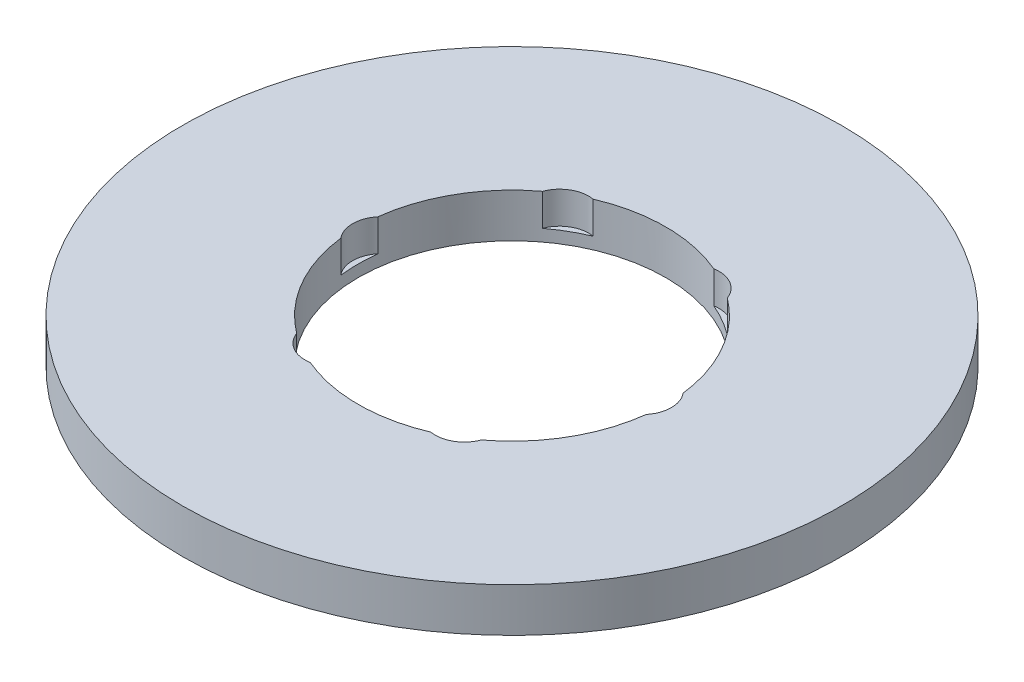
ISO-10303-21;
HEADER;
FILE_DESCRIPTION(('STEP AP214'),'2;1');
FILE_NAME('part.step','',(''),(''),'','','');
FILE_SCHEMA(('AUTOMOTIVE_DESIGN { 1 0 10303 214 1 1 1 1 }'));
ENDSEC;
DATA;
#1=APPLICATION_CONTEXT('core data for automotive mechanical design processes');
#2=APPLICATION_PROTOCOL_DEFINITION('international standard','automotive_design',2000,#1);
#3=PRODUCT_CONTEXT('',#1,'mechanical');
#4=PRODUCT('Part','Part','',(#3));
#5=PRODUCT_RELATED_PRODUCT_CATEGORY('part','',(#4));
#6=PRODUCT_DEFINITION_FORMATION('','',#4);
#7=PRODUCT_DEFINITION_CONTEXT('part definition',#1,'design');
#8=PRODUCT_DEFINITION('design','',#6,#7);
#9=PRODUCT_DEFINITION_SHAPE('','',#8);
#10=(LENGTH_UNIT() NAMED_UNIT(*) SI_UNIT(.MILLI.,.METRE.));
#11=(NAMED_UNIT(*) PLANE_ANGLE_UNIT() SI_UNIT($,.RADIAN.));
#12=(NAMED_UNIT(*) SI_UNIT($,.STERADIAN.) SOLID_ANGLE_UNIT());
#13=UNCERTAINTY_MEASURE_WITH_UNIT(LENGTH_MEASURE(1.E-05),#10,'distance_accuracy_value','');
#14=(GEOMETRIC_REPRESENTATION_CONTEXT(3) GLOBAL_UNCERTAINTY_ASSIGNED_CONTEXT((#13)) GLOBAL_UNIT_ASSIGNED_CONTEXT((#10,
#11,#12)) REPRESENTATION_CONTEXT('',''));
#15=CARTESIAN_POINT('',(0.,0.,0.));
#16=DIRECTION('',(0.,0.,1.));
#17=DIRECTION('',(1.,0.,0.));
#18=AXIS2_PLACEMENT_3D('',#15,#16,#17);
#19=CARTESIAN_POINT('',(0.,5.,0.));
#20=DIRECTION('',(0.,-1.,0.));
#21=DIRECTION('',(0.,0.,-1.));
#22=AXIS2_PLACEMENT_3D('',#19,#20,#21);
#23=CYLINDRICAL_SURFACE('',#22,37.5);
#24=CARTESIAN_POINT('',(0.,5.,0.));
#25=DIRECTION('',(0.,1.,0.));
#26=DIRECTION('',(0.,0.,1.));
#27=AXIS2_PLACEMENT_3D('',#24,#25,#26);
#28=CIRCLE('',#27,37.5);
#29=CARTESIAN_POINT('',(0.,5.,37.5));
#30=VERTEX_POINT('',#29);
#31=EDGE_CURVE('E162',#30,#30,#28,.T.);
#32=ORIENTED_EDGE('',*,*,#31,.F.);
#33=EDGE_LOOP('',(#32));
#34=FACE_BOUND('',#33,.T.);
#35=CARTESIAN_POINT('',(0.,0.,0.));
#36=DIRECTION('',(0.,1.,0.));
#37=DIRECTION('',(0.,0.,1.));
#38=AXIS2_PLACEMENT_3D('',#35,#36,#37);
#39=CIRCLE('',#38,37.5);
#40=CARTESIAN_POINT('',(0.,0.,37.5));
#41=VERTEX_POINT('',#40);
#42=EDGE_CURVE('E157',#41,#41,#39,.T.);
#43=ORIENTED_EDGE('',*,*,#42,.T.);
#44=EDGE_LOOP('',(#43));
#45=FACE_BOUND('',#44,.T.);
#46=ADVANCED_FACE('F39',(#34,#45),#23,.T.);
#47=CARTESIAN_POINT('',(0.,5.,0.));
#48=DIRECTION('',(0.,1.,0.));
#49=DIRECTION('',(0.,0.,1.));
#50=AXIS2_PLACEMENT_3D('',#47,#48,#49);
#51=PLANE('',#50);
#52=CARTESIAN_POINT('',(-7.41666009187124,5.,-12.8460321015891));
#53=DIRECTION('',(0.,1.,0.));
#54=DIRECTION('',(-0.866025403784433,0.,0.50000000000001));
#55=AXIS2_PLACEMENT_3D('',#52,#53,#54);
#56=CIRCLE('',#55,3.29838734099443);
#57=CARTESIAN_POINT('',(-6.86382702181804,5.,-16.097760049602));
#58=VERTEX_POINT('',#57);
#59=CARTESIAN_POINT('',(-10.5091556360728,5.,-13.9931285928772));
#60=VERTEX_POINT('',#59);
#61=EDGE_CURVE('E218',#58,#60,#56,.T.);
#62=ORIENTED_EDGE('',*,*,#61,.F.);
#63=CARTESIAN_POINT('',(0.,5.,0.));
#64=DIRECTION('',(0.,1.,0.));
#65=DIRECTION('',(0.,0.,1.));
#66=AXIS2_PLACEMENT_3D('',#63,#64,#65);
#67=CIRCLE('',#66,17.5);
#68=CARTESIAN_POINT('',(6.8638270218177,5.,-16.0977600496021));
#69=VERTEX_POINT('',#68);
#70=EDGE_CURVE('E169',#69,#58,#67,.T.);
#71=ORIENTED_EDGE('',*,*,#70,.F.);
#72=CARTESIAN_POINT('',(7.41666009187098,5.,-12.8460321015893));
#73=DIRECTION('',(0.,1.,0.));
#74=DIRECTION('',(-0.866025403784443,0.,-0.499999999999992));
#75=AXIS2_PLACEMENT_3D('',#72,#73,#74);
#76=CIRCLE('',#75,3.29838734099443);
#77=CARTESIAN_POINT('',(10.5091556360726,5.,-13.9931285928775));
#78=VERTEX_POINT('',#77);
#79=EDGE_CURVE('E285',#78,#69,#76,.T.);
#80=ORIENTED_EDGE('',*,*,#79,.F.);
#81=CARTESIAN_POINT('',(17.3729826578905,5.,-2.10463145672467));
#82=VERTEX_POINT('',#81);
#83=EDGE_CURVE('E174',#82,#78,#67,.T.);
#84=ORIENTED_EDGE('',*,*,#83,.F.);
#85=CARTESIAN_POINT('',(14.8333201837422,5.,0.));
#86=DIRECTION('',(0.,1.,0.));
#87=DIRECTION('',(0.,0.,-1.));
#88=AXIS2_PLACEMENT_3D('',#85,#86,#87);
#89=CIRCLE('',#88,3.29838734099443);
#90=CARTESIAN_POINT('',(17.3729826578905,5.,2.10463145672467));
#91=VERTEX_POINT('',#90);
#92=EDGE_CURVE('E280',#91,#82,#89,.T.);
#93=ORIENTED_EDGE('',*,*,#92,.F.);
#94=CARTESIAN_POINT('',(10.5091556360728,5.,13.9931285928773));
#95=VERTEX_POINT('',#94);
#96=EDGE_CURVE('E164',#95,#91,#67,.T.);
#97=ORIENTED_EDGE('',*,*,#96,.F.);
#98=CARTESIAN_POINT('',(7.41666009187116,5.,12.8460321015892));
#99=DIRECTION('',(0.,1.,0.));
#100=DIRECTION('',(0.866025403784436,0.,-0.500000000000004));
#101=AXIS2_PLACEMENT_3D('',#98,#99,#100);
#102=CIRCLE('',#101,3.29838734099443);
#103=CARTESIAN_POINT('',(6.86382702181792,5.,16.097760049602));
#104=VERTEX_POINT('',#103);
#105=EDGE_CURVE('E269',#104,#95,#102,.T.);
#106=ORIENTED_EDGE('',*,*,#105,.F.);
#107=CARTESIAN_POINT('',(-6.86382702181781,5.,16.0977600496021));
#108=VERTEX_POINT('',#107);
#109=EDGE_CURVE('E149',#108,#104,#67,.T.);
#110=ORIENTED_EDGE('',*,*,#109,.F.);
#111=CARTESIAN_POINT('',(-7.41666009187106,5.,12.8460321015892));
#112=DIRECTION('',(0.,1.,0.));
#113=DIRECTION('',(0.86602540378444,0.,0.499999999999998));
#114=AXIS2_PLACEMENT_3D('',#111,#112,#113);
#115=CIRCLE('',#114,3.29838734099443);
#116=CARTESIAN_POINT('',(-10.5091556360727,5.,13.9931285928774));
#117=VERTEX_POINT('',#116);
#118=EDGE_CURVE('E128',#117,#108,#115,.T.);
#119=ORIENTED_EDGE('',*,*,#118,.F.);
#120=CARTESIAN_POINT('',(-17.3729826578905,5.,2.10463145672467));
#121=VERTEX_POINT('',#120);
#122=EDGE_CURVE('E148',#121,#117,#67,.T.);
#123=ORIENTED_EDGE('',*,*,#122,.F.);
#124=CARTESIAN_POINT('',(-14.8333201837422,5.,0.));
#125=DIRECTION('',(0.,1.,0.));
#126=DIRECTION('',(0.,0.,1.));
#127=AXIS2_PLACEMENT_3D('',#124,#125,#126);
#128=CIRCLE('',#127,3.29838734099443);
#129=CARTESIAN_POINT('',(-17.3729826578905,5.,-2.10463145672467));
#130=VERTEX_POINT('',#129);
#131=EDGE_CURVE('E179',#130,#121,#128,.T.);
#132=ORIENTED_EDGE('',*,*,#131,.F.);
#133=EDGE_CURVE('E161',#60,#130,#67,.T.);
#134=ORIENTED_EDGE('',*,*,#133,.F.);
#135=EDGE_LOOP('',(#62,#71,#80,#84,#93,#97,#106,#110,#119,#123,#132,#134));
#136=FACE_BOUND('',#135,.T.);
#137=ORIENTED_EDGE('',*,*,#31,.T.);
#138=EDGE_LOOP('',(#137));
#139=FACE_BOUND('',#138,.T.);
#140=ADVANCED_FACE('F141',(#136,#139),#51,.T.);
#141=CARTESIAN_POINT('',(0.,0.,0.));
#142=DIRECTION('',(0.,1.,0.));
#143=DIRECTION('',(0.,0.,1.));
#144=AXIS2_PLACEMENT_3D('',#141,#142,#143);
#145=PLANE('',#144);
#146=CARTESIAN_POINT('',(0.,0.,0.));
#147=DIRECTION('',(0.,1.,0.));
#148=DIRECTION('',(0.,0.,1.));
#149=AXIS2_PLACEMENT_3D('',#146,#147,#148);
#150=CIRCLE('',#149,17.5);
#151=CARTESIAN_POINT('',(0.,0.,17.5));
#152=VERTEX_POINT('',#151);
#153=EDGE_CURVE('E166',#152,#152,#150,.T.);
#154=ORIENTED_EDGE('',*,*,#153,.T.);
#155=EDGE_LOOP('',(#154));
#156=FACE_BOUND('',#155,.T.);
#157=ORIENTED_EDGE('',*,*,#42,.F.);
#158=EDGE_LOOP('',(#157));
#159=FACE_BOUND('',#158,.T.);
#160=ADVANCED_FACE('F234',(#156,#159),#145,.F.);
#161=CARTESIAN_POINT('',(0.,5.,0.));
#162=DIRECTION('',(0.,-1.,0.));
#163=DIRECTION('',(0.,0.,-1.));
#164=AXIS2_PLACEMENT_3D('',#161,#162,#163);
#165=CYLINDRICAL_SURFACE('',#164,17.5);
#166=DIRECTION('',(0.,1.,0.));
#167=VECTOR('',#166,1.);
#168=CARTESIAN_POINT('',(-6.86382702181805,3.17479743362933,-16.097760049602));
#169=LINE('',#168,#167);
#170=CARTESIAN_POINT('',(-6.86382702181804,1.34959486725867,-16.097760049602));
#171=VERTEX_POINT('',#170);
#172=EDGE_CURVE('E11',#171,#58,#169,.T.);
#173=ORIENTED_EDGE('',*,*,#172,.F.);
#174=CARTESIAN_POINT('',(0.,1.34959486725867,0.));
#175=DIRECTION('',(0.,1.,0.));
#176=DIRECTION('',(0.,0.,1.));
#177=AXIS2_PLACEMENT_3D('',#174,#175,#176);
#178=CIRCLE('',#177,17.5);
#179=CARTESIAN_POINT('',(-10.5091556360728,1.34959486725867,-13.9931285928772));
#180=VERTEX_POINT('',#179);
#181=EDGE_CURVE('E214',#171,#180,#178,.T.);
#182=ORIENTED_EDGE('',*,*,#181,.T.);
#183=DIRECTION('',(0.,1.,0.));
#184=VECTOR('',#183,1.);
#185=CARTESIAN_POINT('',(-10.5091556360728,3.17479743362933,-13.9931285928772));
#186=LINE('',#185,#184);
#187=EDGE_CURVE('E46',#60,#180,#186,.F.);
#188=ORIENTED_EDGE('',*,*,#187,.F.);
#189=ORIENTED_EDGE('',*,*,#133,.T.);
#190=DIRECTION('',(0.,1.,0.));
#191=VECTOR('',#190,1.);
#192=CARTESIAN_POINT('',(-17.3729826578905,3.17479743362933,-2.10463145672467));
#193=LINE('',#192,#191);
#194=CARTESIAN_POINT('',(-17.3729826578905,1.34959486725867,-2.10463145672467));
#195=VERTEX_POINT('',#194);
#196=EDGE_CURVE('E187',#195,#130,#193,.T.);
#197=ORIENTED_EDGE('',*,*,#196,.F.);
#198=CARTESIAN_POINT('',(0.,1.34959486725867,0.));
#199=DIRECTION('',(0.,1.,0.));
#200=DIRECTION('',(0.,0.,1.));
#201=AXIS2_PLACEMENT_3D('',#198,#199,#200);
#202=CIRCLE('',#201,17.5);
#203=CARTESIAN_POINT('',(-17.3729826578905,1.34959486725867,2.10463145672467));
#204=VERTEX_POINT('',#203);
#205=EDGE_CURVE('E184',#195,#204,#202,.T.);
#206=ORIENTED_EDGE('',*,*,#205,.T.);
#207=DIRECTION('',(0.,1.,0.));
#208=VECTOR('',#207,1.);
#209=CARTESIAN_POINT('',(-17.3729826578905,3.17479743362933,2.10463145672467));
#210=LINE('',#209,#208);
#211=EDGE_CURVE('E158',#121,#204,#210,.F.);
#212=ORIENTED_EDGE('',*,*,#211,.F.);
#213=ORIENTED_EDGE('',*,*,#122,.T.);
#214=DIRECTION('',(0.,1.,0.));
#215=VECTOR('',#214,1.);
#216=CARTESIAN_POINT('',(-10.5091556360726,3.17479743362933,13.9931285928774));
#217=LINE('',#216,#215);
#218=CARTESIAN_POINT('',(-10.5091556360727,1.34959486725867,13.9931285928774));
#219=VERTEX_POINT('',#218);
#220=EDGE_CURVE('E127',#219,#117,#217,.T.);
#221=ORIENTED_EDGE('',*,*,#220,.F.);
#222=CARTESIAN_POINT('',(0.,1.34959486725867,0.));
#223=DIRECTION('',(0.,1.,0.));
#224=DIRECTION('',(0.,0.,1.));
#225=AXIS2_PLACEMENT_3D('',#222,#223,#224);
#226=CIRCLE('',#225,17.5);
#227=CARTESIAN_POINT('',(-6.86382702181781,1.34959486725867,16.0977600496021));
#228=VERTEX_POINT('',#227);
#229=EDGE_CURVE('E189',#219,#228,#226,.T.);
#230=ORIENTED_EDGE('',*,*,#229,.T.);
#231=DIRECTION('',(0.,1.,0.));
#232=VECTOR('',#231,1.);
#233=CARTESIAN_POINT('',(-6.86382702181782,3.17479743362933,16.0977600496021));
#234=LINE('',#233,#232);
#235=EDGE_CURVE('E140',#108,#228,#234,.F.);
#236=ORIENTED_EDGE('',*,*,#235,.F.);
#237=ORIENTED_EDGE('',*,*,#109,.T.);
#238=DIRECTION('',(0.,1.,0.));
#239=VECTOR('',#238,1.);
#240=CARTESIAN_POINT('',(6.86382702181793,3.17479743362933,16.097760049602));
#241=LINE('',#240,#239);
#242=CARTESIAN_POINT('',(6.86382702181792,1.34959486725867,16.097760049602));
#243=VERTEX_POINT('',#242);
#244=EDGE_CURVE('E196',#243,#104,#241,.T.);
#245=ORIENTED_EDGE('',*,*,#244,.F.);
#246=CARTESIAN_POINT('',(0.,1.34959486725867,0.));
#247=DIRECTION('',(0.,1.,0.));
#248=DIRECTION('',(0.,0.,1.));
#249=AXIS2_PLACEMENT_3D('',#246,#247,#248);
#250=CIRCLE('',#249,17.5);
#251=CARTESIAN_POINT('',(10.5091556360728,1.34959486725867,13.9931285928773));
#252=VERTEX_POINT('',#251);
#253=EDGE_CURVE('E136',#243,#252,#250,.T.);
#254=ORIENTED_EDGE('',*,*,#253,.T.);
#255=DIRECTION('',(0.,1.,0.));
#256=VECTOR('',#255,1.);
#257=CARTESIAN_POINT('',(10.5091556360727,3.17479743362933,13.9931285928773));
#258=LINE('',#257,#256);
#259=EDGE_CURVE('E194',#95,#252,#258,.F.);
#260=ORIENTED_EDGE('',*,*,#259,.F.);
#261=ORIENTED_EDGE('',*,*,#96,.T.);
#262=DIRECTION('',(0.,1.,0.));
#263=VECTOR('',#262,1.);
#264=CARTESIAN_POINT('',(17.3729826578905,3.17479743362933,2.10463145672467));
#265=LINE('',#264,#263);
#266=CARTESIAN_POINT('',(17.3729826578905,1.34959486725867,2.10463145672467));
#267=VERTEX_POINT('',#266);
#268=EDGE_CURVE('E206',#267,#91,#265,.T.);
#269=ORIENTED_EDGE('',*,*,#268,.F.);
#270=CARTESIAN_POINT('',(0.,1.34959486725867,0.));
#271=DIRECTION('',(0.,1.,0.));
#272=DIRECTION('',(0.,0.,1.));
#273=AXIS2_PLACEMENT_3D('',#270,#271,#272);
#274=CIRCLE('',#273,17.5);
#275=CARTESIAN_POINT('',(17.3729826578905,1.34959486725867,-2.10463145672467));
#276=VERTEX_POINT('',#275);
#277=EDGE_CURVE('E199',#267,#276,#274,.T.);
#278=ORIENTED_EDGE('',*,*,#277,.T.);
#279=DIRECTION('',(0.,1.,0.));
#280=VECTOR('',#279,1.);
#281=CARTESIAN_POINT('',(17.3729826578905,3.17479743362933,-2.10463145672467));
#282=LINE('',#281,#280);
#283=EDGE_CURVE('E201',#82,#276,#282,.F.);
#284=ORIENTED_EDGE('',*,*,#283,.F.);
#285=ORIENTED_EDGE('',*,*,#83,.T.);
#286=DIRECTION('',(0.,1.,0.));
#287=VECTOR('',#286,1.);
#288=CARTESIAN_POINT('',(10.5091556360725,3.17479743362933,-13.9931285928775));
#289=LINE('',#288,#287);
#290=CARTESIAN_POINT('',(10.5091556360726,1.34959486725867,-13.9931285928775));
#291=VERTEX_POINT('',#290);
#292=EDGE_CURVE('E213',#291,#78,#289,.T.);
#293=ORIENTED_EDGE('',*,*,#292,.F.);
#294=CARTESIAN_POINT('',(0.,1.34959486725867,0.));
#295=DIRECTION('',(0.,1.,0.));
#296=DIRECTION('',(0.,0.,1.));
#297=AXIS2_PLACEMENT_3D('',#294,#295,#296);
#298=CIRCLE('',#297,17.5);
#299=CARTESIAN_POINT('',(6.8638270218177,1.34959486725867,-16.0977600496021));
#300=VERTEX_POINT('',#299);
#301=EDGE_CURVE('E208',#291,#300,#298,.T.);
#302=ORIENTED_EDGE('',*,*,#301,.T.);
#303=DIRECTION('',(0.,1.,0.));
#304=VECTOR('',#303,1.);
#305=CARTESIAN_POINT('',(6.86382702181771,3.17479743362933,-16.0977600496021));
#306=LINE('',#305,#304);
#307=EDGE_CURVE('E211',#69,#300,#306,.F.);
#308=ORIENTED_EDGE('',*,*,#307,.F.);
#309=ORIENTED_EDGE('',*,*,#70,.T.);
#310=EDGE_LOOP('',(#173,#182,#188,#189,#197,#206,#212,#213,#221,#230,#236,#237,#245,#254,#260,
#261,#269,#278,#284,#285,#293,#302,#308,#309));
#311=FACE_BOUND('',#310,.T.);
#312=ORIENTED_EDGE('',*,*,#153,.F.);
#313=EDGE_LOOP('',(#312));
#314=FACE_BOUND('',#313,.T.);
#315=ADVANCED_FACE('F152',(#311,#314),#165,.F.);
#316=CARTESIAN_POINT('',(-14.8333201837422,1.34959486725867,0.));
#317=DIRECTION('',(0.,1.,0.));
#318=DIRECTION('',(0.,0.,1.));
#319=AXIS2_PLACEMENT_3D('',#316,#317,#318);
#320=CYLINDRICAL_SURFACE('',#319,3.29838734099443);
#321=ORIENTED_EDGE('',*,*,#196,.T.);
#322=ORIENTED_EDGE('',*,*,#131,.T.);
#323=ORIENTED_EDGE('',*,*,#211,.T.);
#324=CARTESIAN_POINT('',(-14.8333201837422,1.34959486725867,0.));
#325=DIRECTION('',(0.,1.,0.));
#326=DIRECTION('',(0.,0.,1.));
#327=AXIS2_PLACEMENT_3D('',#324,#325,#326);
#328=CIRCLE('',#327,3.29838734099443);
#329=EDGE_CURVE('E180',#195,#204,#328,.T.);
#330=ORIENTED_EDGE('',*,*,#329,.F.);
#331=EDGE_LOOP('',(#321,#322,#323,#330));
#332=FACE_BOUND('',#331,.T.);
#333=ADVANCED_FACE('F244',(#332),#320,.F.);
#334=CARTESIAN_POINT('',(-14.8333201837422,1.34959486725867,0.));
#335=DIRECTION('',(0.,1.,0.));
#336=DIRECTION('',(0.,0.,1.));
#337=AXIS2_PLACEMENT_3D('',#334,#335,#336);
#338=PLANE('',#337);
#339=ORIENTED_EDGE('',*,*,#329,.T.);
#340=ORIENTED_EDGE('',*,*,#205,.F.);
#341=EDGE_LOOP('',(#339,#340));
#342=FACE_BOUND('',#341,.T.);
#343=ADVANCED_FACE('F248',(#342),#338,.T.);
#344=CARTESIAN_POINT('',(-7.41666009187106,1.34959486725867,12.8460321015892));
#345=DIRECTION('',(0.,1.,0.));
#346=DIRECTION('',(0.,0.,1.));
#347=AXIS2_PLACEMENT_3D('',#344,#345,#346);
#348=CYLINDRICAL_SURFACE('',#347,3.29838734099443);
#349=ORIENTED_EDGE('',*,*,#220,.T.);
#350=ORIENTED_EDGE('',*,*,#118,.T.);
#351=ORIENTED_EDGE('',*,*,#235,.T.);
#352=CARTESIAN_POINT('',(-7.41666009187106,1.34959486725867,12.8460321015892));
#353=DIRECTION('',(0.,1.,0.));
#354=DIRECTION('',(0.86602540378444,0.,0.499999999999998));
#355=AXIS2_PLACEMENT_3D('',#352,#353,#354);
#356=CIRCLE('',#355,3.29838734099443);
#357=EDGE_CURVE('E135',#219,#228,#356,.T.);
#358=ORIENTED_EDGE('',*,*,#357,.F.);
#359=EDGE_LOOP('',(#349,#350,#351,#358));
#360=FACE_BOUND('',#359,.T.);
#361=ADVANCED_FACE('F126',(#360),#348,.F.);
#362=CARTESIAN_POINT('',(-7.41666009187106,1.34959486725867,12.8460321015892));
#363=DIRECTION('',(0.,1.,0.));
#364=DIRECTION('',(0.86602540378444,0.,0.499999999999998));
#365=AXIS2_PLACEMENT_3D('',#362,#363,#364);
#366=PLANE('',#365);
#367=ORIENTED_EDGE('',*,*,#357,.T.);
#368=ORIENTED_EDGE('',*,*,#229,.F.);
#369=EDGE_LOOP('',(#367,#368));
#370=FACE_BOUND('',#369,.T.);
#371=ADVANCED_FACE('F258',(#370),#366,.T.);
#372=CARTESIAN_POINT('',(7.41666009187116,1.34959486725867,12.8460321015892));
#373=DIRECTION('',(0.,1.,0.));
#374=DIRECTION('',(0.,0.,1.));
#375=AXIS2_PLACEMENT_3D('',#372,#373,#374);
#376=CYLINDRICAL_SURFACE('',#375,3.29838734099443);
#377=ORIENTED_EDGE('',*,*,#244,.T.);
#378=ORIENTED_EDGE('',*,*,#105,.T.);
#379=ORIENTED_EDGE('',*,*,#259,.T.);
#380=CARTESIAN_POINT('',(7.41666009187116,1.34959486725867,12.8460321015892));
#381=DIRECTION('',(0.,1.,0.));
#382=DIRECTION('',(0.866025403784436,0.,-0.500000000000004));
#383=AXIS2_PLACEMENT_3D('',#380,#381,#382);
#384=CIRCLE('',#383,3.29838734099443);
#385=EDGE_CURVE('E147',#243,#252,#384,.T.);
#386=ORIENTED_EDGE('',*,*,#385,.F.);
#387=EDGE_LOOP('',(#377,#378,#379,#386));
#388=FACE_BOUND('',#387,.T.);
#389=ADVANCED_FACE('F256',(#388),#376,.F.);
#390=CARTESIAN_POINT('',(7.41666009187116,1.34959486725867,12.8460321015892));
#391=DIRECTION('',(0.,1.,0.));
#392=DIRECTION('',(0.866025403784436,0.,-0.500000000000004));
#393=AXIS2_PLACEMENT_3D('',#390,#391,#392);
#394=PLANE('',#393);
#395=ORIENTED_EDGE('',*,*,#385,.T.);
#396=ORIENTED_EDGE('',*,*,#253,.F.);
#397=EDGE_LOOP('',(#395,#396));
#398=FACE_BOUND('',#397,.T.);
#399=ADVANCED_FACE('F263',(#398),#394,.T.);
#400=CARTESIAN_POINT('',(14.8333201837422,1.34959486725867,0.));
#401=DIRECTION('',(0.,1.,0.));
#402=DIRECTION('',(0.,0.,1.));
#403=AXIS2_PLACEMENT_3D('',#400,#401,#402);
#404=CYLINDRICAL_SURFACE('',#403,3.29838734099443);
#405=ORIENTED_EDGE('',*,*,#268,.T.);
#406=ORIENTED_EDGE('',*,*,#92,.T.);
#407=ORIENTED_EDGE('',*,*,#283,.T.);
#408=CARTESIAN_POINT('',(14.8333201837422,1.34959486725867,0.));
#409=DIRECTION('',(0.,1.,0.));
#410=DIRECTION('',(0.,0.,-1.));
#411=AXIS2_PLACEMENT_3D('',#408,#409,#410);
#412=CIRCLE('',#411,3.29838734099443);
#413=EDGE_CURVE('E273',#267,#276,#412,.T.);
#414=ORIENTED_EDGE('',*,*,#413,.F.);
#415=EDGE_LOOP('',(#405,#406,#407,#414));
#416=FACE_BOUND('',#415,.T.);
#417=ADVANCED_FACE('F297',(#416),#404,.F.);
#418=CARTESIAN_POINT('',(14.8333201837422,1.34959486725867,0.));
#419=DIRECTION('',(0.,1.,0.));
#420=DIRECTION('',(0.,0.,-1.));
#421=AXIS2_PLACEMENT_3D('',#418,#419,#420);
#422=PLANE('',#421);
#423=ORIENTED_EDGE('',*,*,#413,.T.);
#424=ORIENTED_EDGE('',*,*,#277,.F.);
#425=EDGE_LOOP('',(#423,#424));
#426=FACE_BOUND('',#425,.T.);
#427=ADVANCED_FACE('F299',(#426),#422,.T.);
#428=CARTESIAN_POINT('',(7.41666009187098,1.34959486725867,-12.8460321015893));
#429=DIRECTION('',(0.,1.,0.));
#430=DIRECTION('',(0.,0.,1.));
#431=AXIS2_PLACEMENT_3D('',#428,#429,#430);
#432=CYLINDRICAL_SURFACE('',#431,3.29838734099443);
#433=ORIENTED_EDGE('',*,*,#292,.T.);
#434=ORIENTED_EDGE('',*,*,#79,.T.);
#435=ORIENTED_EDGE('',*,*,#307,.T.);
#436=CARTESIAN_POINT('',(7.41666009187098,1.34959486725867,-12.8460321015893));
#437=DIRECTION('',(0.,1.,0.));
#438=DIRECTION('',(-0.866025403784443,0.,-0.499999999999992));
#439=AXIS2_PLACEMENT_3D('',#436,#437,#438);
#440=CIRCLE('',#439,3.29838734099443);
#441=EDGE_CURVE('E56',#291,#300,#440,.T.);
#442=ORIENTED_EDGE('',*,*,#441,.F.);
#443=EDGE_LOOP('',(#433,#434,#435,#442));
#444=FACE_BOUND('',#443,.T.);
#445=ADVANCED_FACE('F292',(#444),#432,.F.);
#446=CARTESIAN_POINT('',(7.41666009187098,1.34959486725867,-12.8460321015893));
#447=DIRECTION('',(0.,1.,0.));
#448=DIRECTION('',(-0.866025403784443,0.,-0.499999999999992));
#449=AXIS2_PLACEMENT_3D('',#446,#447,#448);
#450=PLANE('',#449);
#451=ORIENTED_EDGE('',*,*,#441,.T.);
#452=ORIENTED_EDGE('',*,*,#301,.F.);
#453=EDGE_LOOP('',(#451,#452));
#454=FACE_BOUND('',#453,.T.);
#455=ADVANCED_FACE('F226',(#454),#450,.T.);
#456=CARTESIAN_POINT('',(-7.41666009187124,1.34959486725867,-12.8460321015891));
#457=DIRECTION('',(0.,1.,0.));
#458=DIRECTION('',(0.,0.,1.));
#459=AXIS2_PLACEMENT_3D('',#456,#457,#458);
#460=CYLINDRICAL_SURFACE('',#459,3.29838734099443);
#461=ORIENTED_EDGE('',*,*,#172,.T.);
#462=ORIENTED_EDGE('',*,*,#61,.T.);
#463=ORIENTED_EDGE('',*,*,#187,.T.);
#464=CARTESIAN_POINT('',(-7.41666009187124,1.34959486725867,-12.8460321015891));
#465=DIRECTION('',(0.,1.,0.));
#466=DIRECTION('',(-0.866025403784433,0.,0.50000000000001));
#467=AXIS2_PLACEMENT_3D('',#464,#465,#466);
#468=CIRCLE('',#467,3.29838734099443);
#469=EDGE_CURVE('E55',#171,#180,#468,.T.);
#470=ORIENTED_EDGE('',*,*,#469,.F.);
#471=EDGE_LOOP('',(#461,#462,#463,#470));
#472=FACE_BOUND('',#471,.T.);
#473=ADVANCED_FACE('F217',(#472),#460,.F.);
#474=CARTESIAN_POINT('',(-7.41666009187124,1.34959486725867,-12.8460321015891));
#475=DIRECTION('',(0.,1.,0.));
#476=DIRECTION('',(-0.866025403784433,0.,0.50000000000001));
#477=AXIS2_PLACEMENT_3D('',#474,#475,#476);
#478=PLANE('',#477);
#479=ORIENTED_EDGE('',*,*,#469,.T.);
#480=ORIENTED_EDGE('',*,*,#181,.F.);
#481=EDGE_LOOP('',(#479,#480));
#482=FACE_BOUND('',#481,.T.);
#483=ADVANCED_FACE('F219',(#482),#478,.T.);
#484=CLOSED_SHELL('',(#46,#140,#160,#315,#333,#343,#361,#371,#389,#399,#417,#427,#445,#455,#473,#483));
#485=MANIFOLD_SOLID_BREP('B2',#484);
#486=ADVANCED_BREP_SHAPE_REPRESENTATION('',(#18,#485),#14);
#487=SHAPE_DEFINITION_REPRESENTATION(#9,#486);
ENDSEC;
END-ISO-10303-21;
